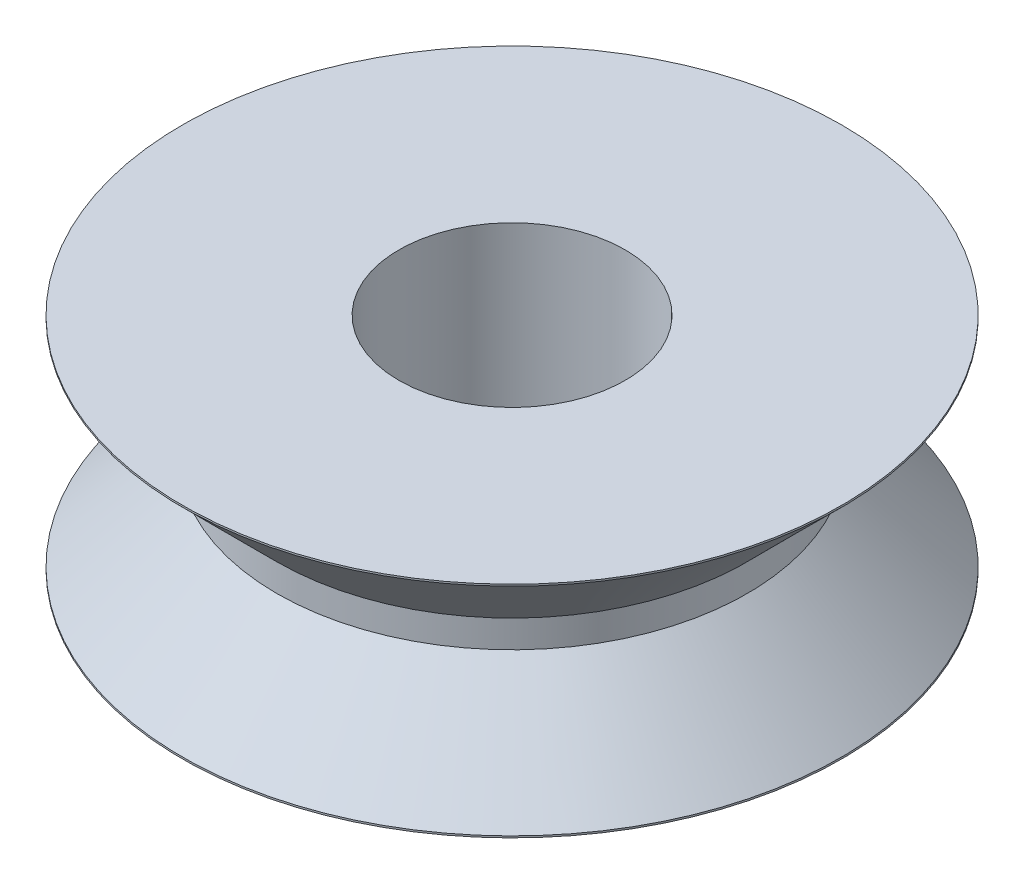
ISO-10303-21;
HEADER;
FILE_DESCRIPTION(('STEP AP214'),'2;1');
FILE_NAME('part.step','',(''),(''),'','','');
FILE_SCHEMA(('AUTOMOTIVE_DESIGN { 1 0 10303 214 1 1 1 1 }'));
ENDSEC;
DATA;
#1=APPLICATION_CONTEXT('core data for automotive mechanical design processes');
#2=APPLICATION_PROTOCOL_DEFINITION('international standard','automotive_design',2000,#1);
#3=PRODUCT_CONTEXT('',#1,'mechanical');
#4=PRODUCT('Part','Part','',(#3));
#5=PRODUCT_RELATED_PRODUCT_CATEGORY('part','',(#4));
#6=PRODUCT_DEFINITION_FORMATION('','',#4);
#7=PRODUCT_DEFINITION_CONTEXT('part definition',#1,'design');
#8=PRODUCT_DEFINITION('design','',#6,#7);
#9=PRODUCT_DEFINITION_SHAPE('','',#8);
#10=(LENGTH_UNIT() NAMED_UNIT(*) SI_UNIT(.MILLI.,.METRE.));
#11=(NAMED_UNIT(*) PLANE_ANGLE_UNIT() SI_UNIT($,.RADIAN.));
#12=(NAMED_UNIT(*) SI_UNIT($,.STERADIAN.) SOLID_ANGLE_UNIT());
#13=UNCERTAINTY_MEASURE_WITH_UNIT(LENGTH_MEASURE(1.E-05),#10,'distance_accuracy_value','');
#14=(GEOMETRIC_REPRESENTATION_CONTEXT(3) GLOBAL_UNCERTAINTY_ASSIGNED_CONTEXT((#13)) GLOBAL_UNIT_ASSIGNED_CONTEXT((#10,
#11,#12)) REPRESENTATION_CONTEXT('',''));
#15=CARTESIAN_POINT('',(0.,0.,0.));
#16=DIRECTION('',(0.,0.,1.));
#17=DIRECTION('',(1.,0.,0.));
#18=AXIS2_PLACEMENT_3D('',#15,#16,#17);
#19=CARTESIAN_POINT('',(0.,12.7,0.));
#20=DIRECTION('',(0.,1.,0.));
#21=DIRECTION('',(0.,0.,1.));
#22=AXIS2_PLACEMENT_3D('',#19,#20,#21);
#23=PLANE('',#22);
#24=CARTESIAN_POINT('',(0.,12.7,0.));
#25=DIRECTION('',(0.,1.,0.));
#26=DIRECTION('',(0.,0.,1.));
#27=AXIS2_PLACEMENT_3D('',#24,#25,#26);
#28=CIRCLE('',#27,6.5405);
#29=CARTESIAN_POINT('',(0.,12.7,6.5405));
#30=VERTEX_POINT('',#29);
#31=EDGE_CURVE('E61',#30,#30,#28,.T.);
#32=ORIENTED_EDGE('',*,*,#31,.F.);
#33=EDGE_LOOP('',(#32));
#34=FACE_BOUND('',#33,.T.);
#35=CARTESIAN_POINT('',(0.,12.7,0.));
#36=DIRECTION('',(0.,-1.,0.));
#37=DIRECTION('',(0.,0.,-1.));
#38=AXIS2_PLACEMENT_3D('',#35,#36,#37);
#39=CIRCLE('',#38,19.05);
#40=CARTESIAN_POINT('',(0.,12.7,-19.05));
#41=VERTEX_POINT('',#40);
#42=EDGE_CURVE('E10',#41,#41,#39,.T.);
#43=ORIENTED_EDGE('',*,*,#42,.F.);
#44=EDGE_LOOP('',(#43));
#45=FACE_BOUND('',#44,.T.);
#46=ADVANCED_FACE('F35',(#34,#45),#23,.T.);
#47=CARTESIAN_POINT('',(0.,0.,0.));
#48=DIRECTION('',(0.,-1.,0.));
#49=DIRECTION('',(0.,0.,-1.));
#50=AXIS2_PLACEMENT_3D('',#47,#48,#49);
#51=CYLINDRICAL_SURFACE('',#50,19.05);
#52=ORIENTED_EDGE('',*,*,#42,.T.);
#53=EDGE_LOOP('',(#52));
#54=FACE_BOUND('',#53,.T.);
#55=CARTESIAN_POINT('',(0.,12.6,0.));
#56=DIRECTION('',(0.,-1.,0.));
#57=DIRECTION('',(0.,0.,-1.));
#58=AXIS2_PLACEMENT_3D('',#55,#56,#57);
#59=CIRCLE('',#58,19.05);
#60=CARTESIAN_POINT('',(0.,12.6,-19.05));
#61=VERTEX_POINT('',#60);
#62=EDGE_CURVE('E41',#61,#61,#59,.T.);
#63=ORIENTED_EDGE('',*,*,#62,.F.);
#64=EDGE_LOOP('',(#63));
#65=FACE_BOUND('',#64,.T.);
#66=ADVANCED_FACE('F78',(#54,#65),#51,.T.);
#67=CARTESIAN_POINT('',(0.,7.14375,0.));
#68=DIRECTION('',(0.,1.,0.));
#69=DIRECTION('',(0.,0.,1.));
#70=AXIS2_PLACEMENT_3D('',#67,#68,#69);
#71=CONICAL_SURFACE('',#70,13.59375,0.785398163397452);
#72=ORIENTED_EDGE('',*,*,#62,.T.);
#73=EDGE_LOOP('',(#72));
#74=FACE_BOUND('',#73,.T.);
#75=CARTESIAN_POINT('',(0.,7.14375,0.));
#76=DIRECTION('',(0.,-1.,0.));
#77=DIRECTION('',(0.,0.,-1.));
#78=AXIS2_PLACEMENT_3D('',#75,#76,#77);
#79=CIRCLE('',#78,13.59375);
#80=CARTESIAN_POINT('',(0.,7.14375,-13.59375));
#81=VERTEX_POINT('',#80);
#82=EDGE_CURVE('E45',#81,#81,#79,.T.);
#83=ORIENTED_EDGE('',*,*,#82,.F.);
#84=EDGE_LOOP('',(#83));
#85=FACE_BOUND('',#84,.T.);
#86=ADVANCED_FACE('F82',(#74,#85),#71,.T.);
#87=CARTESIAN_POINT('',(0.,0.,0.));
#88=DIRECTION('',(0.,-1.,0.));
#89=DIRECTION('',(0.,0.,-1.));
#90=AXIS2_PLACEMENT_3D('',#87,#88,#89);
#91=CYLINDRICAL_SURFACE('',#90,13.59375);
#92=ORIENTED_EDGE('',*,*,#82,.T.);
#93=EDGE_LOOP('',(#92));
#94=FACE_BOUND('',#93,.T.);
#95=CARTESIAN_POINT('',(0.,5.55625,0.));
#96=DIRECTION('',(0.,-1.,0.));
#97=DIRECTION('',(0.,0.,-1.));
#98=AXIS2_PLACEMENT_3D('',#95,#96,#97);
#99=CIRCLE('',#98,13.59375);
#100=CARTESIAN_POINT('',(0.,5.55625,-13.59375));
#101=VERTEX_POINT('',#100);
#102=EDGE_CURVE('E49',#101,#101,#99,.T.);
#103=ORIENTED_EDGE('',*,*,#102,.F.);
#104=EDGE_LOOP('',(#103));
#105=FACE_BOUND('',#104,.T.);
#106=ADVANCED_FACE('F86',(#94,#105),#91,.T.);
#107=CARTESIAN_POINT('',(0.,0.100000000000002,0.));
#108=DIRECTION('',(0.,-1.,0.));
#109=DIRECTION('',(0.,0.,-1.));
#110=AXIS2_PLACEMENT_3D('',#107,#108,#109);
#111=CONICAL_SURFACE('',#110,19.05,0.785398163397452);
#112=ORIENTED_EDGE('',*,*,#102,.T.);
#113=EDGE_LOOP('',(#112));
#114=FACE_BOUND('',#113,.T.);
#115=CARTESIAN_POINT('',(0.,0.100000000000002,0.));
#116=DIRECTION('',(0.,-1.,0.));
#117=DIRECTION('',(0.,0.,-1.));
#118=AXIS2_PLACEMENT_3D('',#115,#116,#117);
#119=CIRCLE('',#118,19.05);
#120=CARTESIAN_POINT('',(0.,0.100000000000002,-19.05));
#121=VERTEX_POINT('',#120);
#122=EDGE_CURVE('E54',#121,#121,#119,.T.);
#123=ORIENTED_EDGE('',*,*,#122,.F.);
#124=EDGE_LOOP('',(#123));
#125=FACE_BOUND('',#124,.T.);
#126=ADVANCED_FACE('F92',(#114,#125),#111,.T.);
#127=CARTESIAN_POINT('',(0.,0.,0.));
#128=DIRECTION('',(0.,-1.,0.));
#129=DIRECTION('',(0.,0.,-1.));
#130=AXIS2_PLACEMENT_3D('',#127,#128,#129);
#131=CYLINDRICAL_SURFACE('',#130,19.05);
#132=ORIENTED_EDGE('',*,*,#122,.T.);
#133=EDGE_LOOP('',(#132));
#134=FACE_BOUND('',#133,.T.);
#135=CARTESIAN_POINT('',(0.,0.,0.));
#136=DIRECTION('',(0.,-1.,0.));
#137=DIRECTION('',(0.,0.,-1.));
#138=AXIS2_PLACEMENT_3D('',#135,#136,#137);
#139=CIRCLE('',#138,19.05);
#140=CARTESIAN_POINT('',(0.,0.,-19.05));
#141=VERTEX_POINT('',#140);
#142=EDGE_CURVE('E57',#141,#141,#139,.T.);
#143=ORIENTED_EDGE('',*,*,#142,.F.);
#144=EDGE_LOOP('',(#143));
#145=FACE_BOUND('',#144,.T.);
#146=ADVANCED_FACE('F96',(#134,#145),#131,.T.);
#147=CARTESIAN_POINT('',(0.,0.,0.));
#148=DIRECTION('',(0.,-1.,0.));
#149=DIRECTION('',(0.,0.,-1.));
#150=AXIS2_PLACEMENT_3D('',#147,#148,#149);
#151=PLANE('',#150);
#152=CARTESIAN_POINT('',(0.,0.,0.));
#153=DIRECTION('',(0.,1.,0.));
#154=DIRECTION('',(0.,0.,1.));
#155=AXIS2_PLACEMENT_3D('',#152,#153,#154);
#156=CIRCLE('',#155,6.5405);
#157=CARTESIAN_POINT('',(0.,0.,6.5405));
#158=VERTEX_POINT('',#157);
#159=EDGE_CURVE('E60',#158,#158,#156,.T.);
#160=ORIENTED_EDGE('',*,*,#159,.T.);
#161=EDGE_LOOP('',(#160));
#162=FACE_BOUND('',#161,.T.);
#163=ORIENTED_EDGE('',*,*,#142,.T.);
#164=EDGE_LOOP('',(#163));
#165=FACE_BOUND('',#164,.T.);
#166=ADVANCED_FACE('F67',(#162,#165),#151,.T.);
#167=CARTESIAN_POINT('',(0.,0.,0.));
#168=DIRECTION('',(0.,1.,0.));
#169=DIRECTION('',(0.,0.,1.));
#170=AXIS2_PLACEMENT_3D('',#167,#168,#169);
#171=CYLINDRICAL_SURFACE('',#170,6.5405);
#172=ORIENTED_EDGE('',*,*,#159,.F.);
#173=EDGE_LOOP('',(#172));
#174=FACE_BOUND('',#173,.T.);
#175=ORIENTED_EDGE('',*,*,#31,.T.);
#176=EDGE_LOOP('',(#175));
#177=FACE_BOUND('',#176,.T.);
#178=ADVANCED_FACE('F70',(#174,#177),#171,.F.);
#179=CLOSED_SHELL('',(#46,#66,#86,#106,#126,#146,#166,#178));
#180=MANIFOLD_SOLID_BREP('B2',#179);
#181=ADVANCED_BREP_SHAPE_REPRESENTATION('',(#18,#180),#14);
#182=SHAPE_DEFINITION_REPRESENTATION(#9,#181);
ENDSEC;
END-ISO-10303-21;
